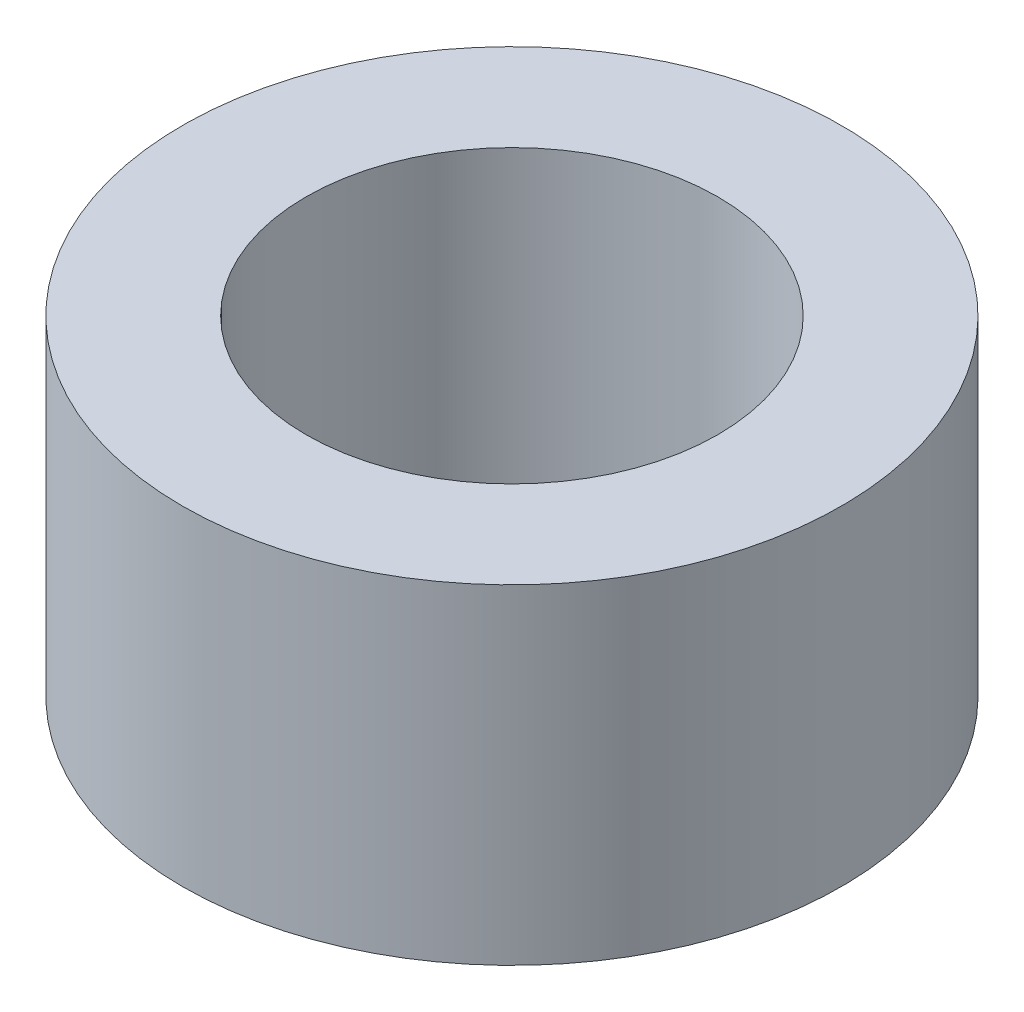
ISO-10303-21;
HEADER;
FILE_DESCRIPTION(('STEP AP214'),'2;1');
FILE_NAME('part.step','',(''),(''),'','','');
FILE_SCHEMA(('AUTOMOTIVE_DESIGN { 1 0 10303 214 1 1 1 1 }'));
ENDSEC;
DATA;
#1=APPLICATION_CONTEXT('core data for automotive mechanical design processes');
#2=APPLICATION_PROTOCOL_DEFINITION('international standard','automotive_design',2000,#1);
#3=PRODUCT_CONTEXT('',#1,'mechanical');
#4=PRODUCT('Part','Part','',(#3));
#5=PRODUCT_RELATED_PRODUCT_CATEGORY('part','',(#4));
#6=PRODUCT_DEFINITION_FORMATION('','',#4);
#7=PRODUCT_DEFINITION_CONTEXT('part definition',#1,'design');
#8=PRODUCT_DEFINITION('design','',#6,#7);
#9=PRODUCT_DEFINITION_SHAPE('','',#8);
#10=(LENGTH_UNIT() NAMED_UNIT(*) SI_UNIT(.MILLI.,.METRE.));
#11=(NAMED_UNIT(*) PLANE_ANGLE_UNIT() SI_UNIT($,.RADIAN.));
#12=(NAMED_UNIT(*) SI_UNIT($,.STERADIAN.) SOLID_ANGLE_UNIT());
#13=UNCERTAINTY_MEASURE_WITH_UNIT(LENGTH_MEASURE(1.E-05),#10,'distance_accuracy_value','');
#14=(GEOMETRIC_REPRESENTATION_CONTEXT(3) GLOBAL_UNCERTAINTY_ASSIGNED_CONTEXT((#13)) GLOBAL_UNIT_ASSIGNED_CONTEXT((#10,
#11,#12)) REPRESENTATION_CONTEXT('',''));
#15=CARTESIAN_POINT('',(0.,0.,0.));
#16=DIRECTION('',(0.,0.,1.));
#17=DIRECTION('',(1.,0.,0.));
#18=AXIS2_PLACEMENT_3D('',#15,#16,#17);
#19=CARTESIAN_POINT('',(0.,2.5,0.));
#20=DIRECTION('',(0.,1.,0.));
#21=DIRECTION('',(0.,0.,1.));
#22=AXIS2_PLACEMENT_3D('',#19,#20,#21);
#23=PLANE('',#22);
#24=CARTESIAN_POINT('',(0.,2.5,0.));
#25=DIRECTION('',(0.,1.,0.));
#26=DIRECTION('',(0.,0.,1.));
#27=AXIS2_PLACEMENT_3D('',#24,#25,#26);
#28=CIRCLE('',#27,5.);
#29=CARTESIAN_POINT('',(0.,2.5,5.));
#30=VERTEX_POINT('',#29);
#31=EDGE_CURVE('E10',#30,#30,#28,.T.);
#32=ORIENTED_EDGE('',*,*,#31,.T.);
#33=EDGE_LOOP('',(#32));
#34=FACE_BOUND('',#33,.T.);
#35=CARTESIAN_POINT('',(0.,2.5,0.));
#36=DIRECTION('',(0.,1.,0.));
#37=DIRECTION('',(0.,0.,1.));
#38=AXIS2_PLACEMENT_3D('',#35,#36,#37);
#39=CIRCLE('',#38,3.125);
#40=CARTESIAN_POINT('',(0.,2.5,3.125));
#41=VERTEX_POINT('',#40);
#42=EDGE_CURVE('E42',#41,#41,#39,.T.);
#43=ORIENTED_EDGE('',*,*,#42,.F.);
#44=EDGE_LOOP('',(#43));
#45=FACE_BOUND('',#44,.T.);
#46=ADVANCED_FACE('F31',(#34,#45),#23,.T.);
#47=CARTESIAN_POINT('',(0.,-2.5,0.));
#48=DIRECTION('',(0.,1.,0.));
#49=DIRECTION('',(0.,0.,1.));
#50=AXIS2_PLACEMENT_3D('',#47,#48,#49);
#51=PLANE('',#50);
#52=CARTESIAN_POINT('',(0.,-2.5,0.));
#53=DIRECTION('',(0.,1.,0.));
#54=DIRECTION('',(0.,0.,1.));
#55=AXIS2_PLACEMENT_3D('',#52,#53,#54);
#56=CIRCLE('',#55,5.);
#57=CARTESIAN_POINT('',(0.,-2.5,5.));
#58=VERTEX_POINT('',#57);
#59=EDGE_CURVE('E35',#58,#58,#56,.T.);
#60=ORIENTED_EDGE('',*,*,#59,.F.);
#61=EDGE_LOOP('',(#60));
#62=FACE_BOUND('',#61,.T.);
#63=CARTESIAN_POINT('',(0.,-2.5,0.));
#64=DIRECTION('',(0.,1.,0.));
#65=DIRECTION('',(0.,0.,1.));
#66=AXIS2_PLACEMENT_3D('',#63,#64,#65);
#67=CIRCLE('',#66,3.125);
#68=CARTESIAN_POINT('',(0.,-2.5,3.125));
#69=VERTEX_POINT('',#68);
#70=EDGE_CURVE('E44',#69,#69,#67,.T.);
#71=ORIENTED_EDGE('',*,*,#70,.T.);
#72=EDGE_LOOP('',(#71));
#73=FACE_BOUND('',#72,.T.);
#74=ADVANCED_FACE('F54',(#62,#73),#51,.F.);
#75=CARTESIAN_POINT('',(0.,2.5,0.));
#76=DIRECTION('',(0.,-1.,0.));
#77=DIRECTION('',(0.,0.,-1.));
#78=AXIS2_PLACEMENT_3D('',#75,#76,#77);
#79=CYLINDRICAL_SURFACE('',#78,5.);
#80=ORIENTED_EDGE('',*,*,#31,.F.);
#81=EDGE_LOOP('',(#80));
#82=FACE_BOUND('',#81,.T.);
#83=ORIENTED_EDGE('',*,*,#59,.T.);
#84=EDGE_LOOP('',(#83));
#85=FACE_BOUND('',#84,.T.);
#86=ADVANCED_FACE('F33',(#82,#85),#79,.T.);
#87=CARTESIAN_POINT('',(0.,2.5,0.));
#88=DIRECTION('',(0.,-1.,0.));
#89=DIRECTION('',(0.,0.,-1.));
#90=AXIS2_PLACEMENT_3D('',#87,#88,#89);
#91=CYLINDRICAL_SURFACE('',#90,3.125);
#92=ORIENTED_EDGE('',*,*,#42,.T.);
#93=EDGE_LOOP('',(#92));
#94=FACE_BOUND('',#93,.T.);
#95=ORIENTED_EDGE('',*,*,#70,.F.);
#96=EDGE_LOOP('',(#95));
#97=FACE_BOUND('',#96,.T.);
#98=ADVANCED_FACE('F50',(#94,#97),#91,.F.);
#99=CLOSED_SHELL('',(#46,#74,#86,#98));
#100=MANIFOLD_SOLID_BREP('B2',#99);
#101=ADVANCED_BREP_SHAPE_REPRESENTATION('',(#18,#100),#14);
#102=SHAPE_DEFINITION_REPRESENTATION(#9,#101);
ENDSEC;
END-ISO-10303-21;
